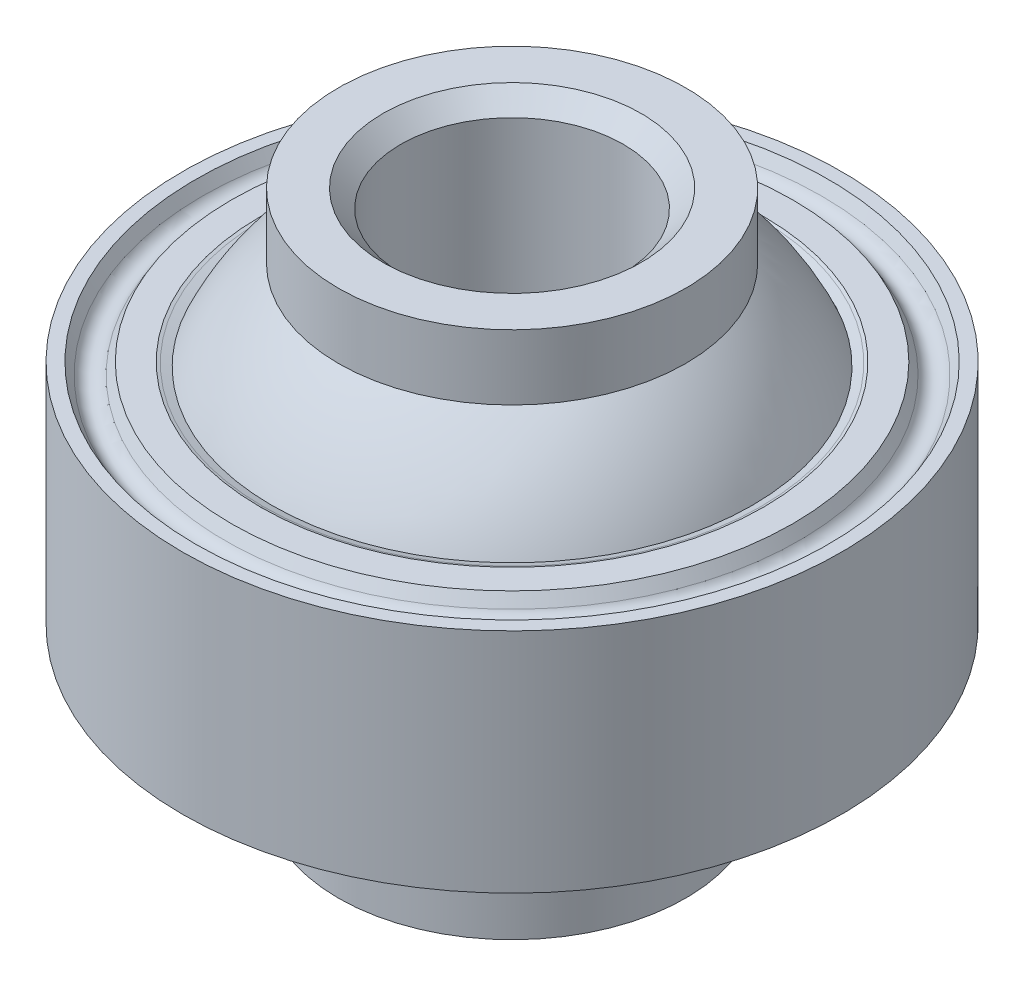
ISO-10303-21;
HEADER;
FILE_DESCRIPTION(('STEP AP214'),'2;1');
FILE_NAME('part.step','',(''),(''),'','','');
FILE_SCHEMA(('AUTOMOTIVE_DESIGN { 1 0 10303 214 1 1 1 1 }'));
ENDSEC;
DATA;
#1=APPLICATION_CONTEXT('core data for automotive mechanical design processes');
#2=APPLICATION_PROTOCOL_DEFINITION('international standard','automotive_design',2000,#1);
#3=PRODUCT_CONTEXT('',#1,'mechanical');
#4=PRODUCT('Part','Part','',(#3));
#5=PRODUCT_RELATED_PRODUCT_CATEGORY('part','',(#4));
#6=PRODUCT_DEFINITION_FORMATION('','',#4);
#7=PRODUCT_DEFINITION_CONTEXT('part definition',#1,'design');
#8=PRODUCT_DEFINITION('design','',#6,#7);
#9=PRODUCT_DEFINITION_SHAPE('','',#8);
#10=(LENGTH_UNIT() NAMED_UNIT(*) SI_UNIT(.MILLI.,.METRE.));
#11=(NAMED_UNIT(*) PLANE_ANGLE_UNIT() SI_UNIT($,.RADIAN.));
#12=(NAMED_UNIT(*) SI_UNIT($,.STERADIAN.) SOLID_ANGLE_UNIT());
#13=UNCERTAINTY_MEASURE_WITH_UNIT(LENGTH_MEASURE(1.E-05),#10,'distance_accuracy_value','');
#14=(GEOMETRIC_REPRESENTATION_CONTEXT(3) GLOBAL_UNCERTAINTY_ASSIGNED_CONTEXT((#13)) GLOBAL_UNIT_ASSIGNED_CONTEXT((#10,
#11,#12)) REPRESENTATION_CONTEXT('',''));
#15=CARTESIAN_POINT('',(0.,0.,0.));
#16=DIRECTION('',(0.,0.,1.));
#17=DIRECTION('',(1.,0.,0.));
#18=AXIS2_PLACEMENT_3D('',#15,#16,#17);
#19=CARTESIAN_POINT('',(0.,0.,0.));
#20=DIRECTION('',(0.,1.,0.));
#21=DIRECTION('',(0.,0.,1.));
#22=AXIS2_PLACEMENT_3D('',#19,#20,#21);
#23=CYLINDRICAL_SURFACE('',#22,3.175);
#24=CARTESIAN_POINT('',(0.,7.02310000002626,0.));
#25=DIRECTION('',(0.,1.,0.));
#26=DIRECTION('',(0.,0.,-1.));
#27=AXIS2_PLACEMENT_3D('',#24,#25,#26);
#28=CIRCLE('',#27,3.17499999999882);
#29=CARTESIAN_POINT('',(0.,7.02310000002626,-3.17499999999882));
#30=VERTEX_POINT('',#29);
#31=EDGE_CURVE('P0_E57',#30,#30,#28,.T.);
#32=ORIENTED_EDGE('',*,*,#31,.T.);
#33=EDGE_LOOP('',(#32));
#34=FACE_BOUND('',#33,.T.);
#35=CARTESIAN_POINT('',(0.,-7.02310000002626,0.));
#36=DIRECTION('',(0.,-1.,0.));
#37=DIRECTION('',(0.,0.,-1.));
#38=AXIS2_PLACEMENT_3D('',#35,#36,#37);
#39=CIRCLE('',#38,3.17499999999882);
#40=CARTESIAN_POINT('',(0.,-7.02310000002626,-3.17499999999882));
#41=VERTEX_POINT('',#40);
#42=EDGE_CURVE('P0_E60',#41,#41,#39,.T.);
#43=ORIENTED_EDGE('',*,*,#42,.T.);
#44=EDGE_LOOP('',(#43));
#45=FACE_BOUND('',#44,.T.);
#46=ADVANCED_FACE('P0_F24',(#34,#45),#23,.F.);
#47=CARTESIAN_POINT('',(0.,-7.53110000010793,0.));
#48=DIRECTION('',(0.,-1.,0.));
#49=DIRECTION('',(0.,0.,-1.));
#50=AXIS2_PLACEMENT_3D('',#47,#48,#49);
#51=CONICAL_SURFACE('',#50,3.68300000008048,0.785398163397448);
#52=CARTESIAN_POINT('',(0.,-7.53110000005108,0.));
#53=DIRECTION('',(0.,-1.,0.));
#54=DIRECTION('',(0.,0.,-1.));
#55=AXIS2_PLACEMENT_3D('',#52,#53,#54);
#56=CIRCLE('',#55,3.68300000002364);
#57=CARTESIAN_POINT('',(0.,-7.53110000005108,-3.68300000002364));
#58=VERTEX_POINT('',#57);
#59=EDGE_CURVE('P0_E27',#58,#58,#56,.F.);
#60=ORIENTED_EDGE('',*,*,#59,.F.);
#61=EDGE_LOOP('',(#60));
#62=FACE_BOUND('',#61,.T.);
#63=ORIENTED_EDGE('',*,*,#42,.F.);
#64=EDGE_LOOP('',(#63));
#65=FACE_BOUND('',#64,.T.);
#66=ADVANCED_FACE('P0_F78',(#62,#65),#51,.F.);
#67=CARTESIAN_POINT('',(0.,7.53110000010793,0.));
#68=DIRECTION('',(0.,1.,0.));
#69=DIRECTION('',(-1.,0.,0.));
#70=AXIS2_PLACEMENT_3D('',#67,#68,#69);
#71=CONICAL_SURFACE('',#70,3.68300000008048,0.785398163397448);
#72=CARTESIAN_POINT('',(0.,7.53110000005108,0.));
#73=DIRECTION('',(0.,1.,0.));
#74=DIRECTION('',(-1.,0.,0.));
#75=AXIS2_PLACEMENT_3D('',#72,#73,#74);
#76=CIRCLE('',#75,3.68300000002364);
#77=CARTESIAN_POINT('',(-3.68300000002364,7.53110000005108,0.));
#78=VERTEX_POINT('',#77);
#79=EDGE_CURVE('P0_E69',#78,#78,#76,.F.);
#80=ORIENTED_EDGE('',*,*,#79,.F.);
#81=EDGE_LOOP('',(#80));
#82=FACE_BOUND('',#81,.T.);
#83=ORIENTED_EDGE('',*,*,#31,.F.);
#84=EDGE_LOOP('',(#83));
#85=FACE_BOUND('',#84,.T.);
#86=ADVANCED_FACE('P0_F81',(#82,#85),#71,.F.);
#87=CARTESIAN_POINT('',(0.,-7.5311,0.));
#88=DIRECTION('',(0.,-1.,0.));
#89=DIRECTION('',(0.,0.,-1.));
#90=AXIS2_PLACEMENT_3D('',#87,#88,#89);
#91=PLANE('',#90);
#92=CARTESIAN_POINT('',(0.,-7.5311,0.));
#93=DIRECTION('',(0.,1.,0.));
#94=DIRECTION('',(0.,0.,1.));
#95=AXIS2_PLACEMENT_3D('',#92,#93,#94);
#96=CIRCLE('',#95,4.953);
#97=CARTESIAN_POINT('',(0.,-7.5311,4.953));
#98=VERTEX_POINT('',#97);
#99=EDGE_CURVE('P0_E67',#98,#98,#96,.T.);
#100=ORIENTED_EDGE('',*,*,#99,.F.);
#101=EDGE_LOOP('',(#100));
#102=FACE_BOUND('',#101,.T.);
#103=ORIENTED_EDGE('',*,*,#59,.T.);
#104=EDGE_LOOP('',(#103));
#105=FACE_BOUND('',#104,.T.);
#106=ADVANCED_FACE('P0_F76',(#102,#105),#91,.T.);
#107=CARTESIAN_POINT('',(0.,7.5311,0.));
#108=DIRECTION('',(0.,1.,0.));
#109=DIRECTION('',(0.,0.,1.));
#110=AXIS2_PLACEMENT_3D('',#107,#108,#109);
#111=PLANE('',#110);
#112=CARTESIAN_POINT('',(0.,7.5311,0.));
#113=DIRECTION('',(0.,1.,0.));
#114=DIRECTION('',(0.,0.,1.));
#115=AXIS2_PLACEMENT_3D('',#112,#113,#114);
#116=CIRCLE('',#115,4.953);
#117=CARTESIAN_POINT('',(0.,7.5311,4.953));
#118=VERTEX_POINT('',#117);
#119=EDGE_CURVE('P0_E64',#118,#118,#116,.F.);
#120=ORIENTED_EDGE('',*,*,#119,.F.);
#121=EDGE_LOOP('',(#120));
#122=FACE_BOUND('',#121,.T.);
#123=ORIENTED_EDGE('',*,*,#79,.T.);
#124=EDGE_LOOP('',(#123));
#125=FACE_BOUND('',#124,.T.);
#126=ADVANCED_FACE('P0_F96',(#122,#125),#111,.T.);
#127=CARTESIAN_POINT('',(0.,0.,0.));
#128=DIRECTION('',(0.,1.,0.));
#129=DIRECTION('',(0.,0.,1.));
#130=AXIS2_PLACEMENT_3D('',#127,#128,#129);
#131=CYLINDRICAL_SURFACE('',#130,4.953);
#132=ORIENTED_EDGE('',*,*,#99,.T.);
#133=EDGE_LOOP('',(#132));
#134=FACE_BOUND('',#133,.T.);
#135=CARTESIAN_POINT('',(0.,-5.6732052853744,0.));
#136=DIRECTION('',(0.,1.,0.));
#137=DIRECTION('',(0.,0.,1.));
#138=AXIS2_PLACEMENT_3D('',#135,#136,#137);
#139=CIRCLE('',#138,4.953);
#140=CARTESIAN_POINT('',(0.,-5.6732052853744,4.953));
#141=VERTEX_POINT('',#140);
#142=EDGE_CURVE('P0_E33',#141,#141,#139,.T.);
#143=ORIENTED_EDGE('',*,*,#142,.F.);
#144=EDGE_LOOP('',(#143));
#145=FACE_BOUND('',#144,.T.);
#146=ADVANCED_FACE('P0_F48',(#134,#145),#131,.T.);
#147=CARTESIAN_POINT('',(0.,0.,0.));
#148=DIRECTION('',(0.,1.,0.));
#149=DIRECTION('',(0.,0.,1.));
#150=AXIS2_PLACEMENT_3D('',#147,#148,#149);
#151=CYLINDRICAL_SURFACE('',#150,4.953);
#152=CARTESIAN_POINT('',(0.,5.6732052853744,0.));
#153=DIRECTION('',(0.,1.,0.));
#154=DIRECTION('',(0.,0.,1.));
#155=AXIS2_PLACEMENT_3D('',#152,#153,#154);
#156=CIRCLE('',#155,4.953);
#157=CARTESIAN_POINT('',(0.,5.6732052853744,4.953));
#158=VERTEX_POINT('',#157);
#159=EDGE_CURVE('P0_E13',#158,#158,#156,.F.);
#160=ORIENTED_EDGE('',*,*,#159,.F.);
#161=EDGE_LOOP('',(#160));
#162=FACE_BOUND('',#161,.T.);
#163=ORIENTED_EDGE('',*,*,#119,.T.);
#164=EDGE_LOOP('',(#163));
#165=FACE_BOUND('',#164,.T.);
#166=ADVANCED_FACE('P0_F41',(#162,#165),#151,.T.);
#167=CARTESIAN_POINT('',(0.,0.,0.));
#168=DIRECTION('',(1.,0.,0.));
#169=DIRECTION('',(0.,1.,0.));
#170=AXIS2_PLACEMENT_3D('',#167,#168,#169);
#171=SPHERICAL_SURFACE('',#170,7.5311);
#172=ORIENTED_EDGE('',*,*,#142,.T.);
#173=EDGE_LOOP('',(#172));
#174=FACE_BOUND('',#173,.T.);
#175=ORIENTED_EDGE('',*,*,#159,.T.);
#176=EDGE_LOOP('',(#175));
#177=FACE_BOUND('',#176,.T.);
#178=CARTESIAN_POINT('',(-7.5311,0.,0.));
#179=VERTEX_POINT('',#178);
#180=VERTEX_LOOP('',#179);
#181=FACE_BOUND('',#180,.T.);
#182=CARTESIAN_POINT('',(7.5311,0.,0.));
#183=VERTEX_POINT('',#182);
#184=VERTEX_LOOP('',#183);
#185=FACE_BOUND('',#184,.T.);
#186=ADVANCED_FACE('P0_F39',(#174,#177,#181,#185),#171,.T.);
#187=CLOSED_SHELL('',(#46,#66,#86,#106,#126,#146,#166,#186));
#188=MANIFOLD_SOLID_BREP('P0_B1',#187);
#189=CARTESIAN_POINT('',(0.,0.,0.));
#190=DIRECTION('',(0.,-1.,0.));
#191=DIRECTION('',(0.,0.,-1.));
#192=AXIS2_PLACEMENT_3D('',#189,#190,#191);
#193=DEGENERATE_TOROIDAL_SURFACE('',#192,0.00762000000000092,7.52422121857329,.T.);
#194=CARTESIAN_POINT('',(0.,3.12138692186181,0.));
#195=DIRECTION('',(0.,1.,0.));
#196=DIRECTION('',(1.,0.,0.));
#197=AXIS2_PLACEMENT_3D('',#194,#195,#196);
#198=CIRCLE('',#197,6.85384878886452);
#199=CARTESIAN_POINT('',(6.85384878886452,3.12138692186181,0.));
#200=VERTEX_POINT('',#199);
#201=EDGE_CURVE('P1_E133',#200,#200,#198,.T.);
#202=ORIENTED_EDGE('',*,*,#201,.T.);
#203=EDGE_LOOP('',(#202));
#204=FACE_BOUND('',#203,.T.);
#205=CARTESIAN_POINT('',(0.,-3.12138692189023,0.));
#206=DIRECTION('',(0.,-1.,0.));
#207=DIRECTION('',(1.,0.,0.));
#208=AXIS2_PLACEMENT_3D('',#205,#206,#207);
#209=CIRCLE('',#208,6.85384878880768);
#210=CARTESIAN_POINT('',(6.85384878880768,-3.12138692189023,0.));
#211=VERTEX_POINT('',#210);
#212=EDGE_CURVE('P1_E137',#211,#211,#209,.T.);
#213=ORIENTED_EDGE('',*,*,#212,.T.);
#214=EDGE_LOOP('',(#213));
#215=FACE_BOUND('',#214,.T.);
#216=ADVANCED_FACE('P1_F24',(#204,#215),#193,.F.);
#217=CARTESIAN_POINT('',(0.,-3.20848073371849,0.));
#218=DIRECTION('',(0.,-1.,0.));
#219=DIRECTION('',(1.,0.,0.));
#220=AXIS2_PLACEMENT_3D('',#217,#218,#219);
#221=CONICAL_SURFACE('',#220,7.09326707806213,1.22190500926642);
#222=ORIENTED_EDGE('',*,*,#212,.F.);
#223=EDGE_LOOP('',(#222));
#224=FACE_BOUND('',#223,.T.);
#225=CARTESIAN_POINT('',(0.,-3.2084807338012,0.));
#226=DIRECTION('',(0.,-1.,0.));
#227=DIRECTION('',(-1.,0.,0.));
#228=AXIS2_PLACEMENT_3D('',#225,#226,#227);
#229=CIRCLE('',#228,7.0932670782895);
#230=CARTESIAN_POINT('',(-7.09326914803703,-3.20847333234299,0.));
#231=VERTEX_POINT('',#230);
#232=CARTESIAN_POINT('',(0.,-3.20847345069136,-7.09326951839364));
#233=VERTEX_POINT('',#232);
#234=EDGE_CURVE('P1_E250',#231,#233,#229,.T.);
#235=ORIENTED_EDGE('',*,*,#234,.T.);
#236=CARTESIAN_POINT('',(0.,-3.2084807338012,0.));
#237=DIRECTION('',(0.,-1.,0.));
#238=DIRECTION('',(0.,0.,-1.));
#239=AXIS2_PLACEMENT_3D('',#236,#237,#238);
#240=CIRCLE('',#239,7.0932670782895);
#241=CARTESIAN_POINT('',(0.,-3.20847343916724,7.09326941906428));
#242=VERTEX_POINT('',#241);
#243=EDGE_CURVE('P1_E76',#233,#242,#240,.T.);
#244=ORIENTED_EDGE('',*,*,#243,.T.);
#245=CARTESIAN_POINT('',(0.,-3.20848033326683,0.));
#246=DIRECTION('',(0.,-1.,0.));
#247=DIRECTION('',(0.,0.,1.));
#248=AXIS2_PLACEMENT_3D('',#245,#246,#247);
#249=CIRCLE('',#248,7.09326597723248);
#250=EDGE_CURVE('P1_E136',#242,#231,#249,.T.);
#251=ORIENTED_EDGE('',*,*,#250,.T.);
#252=EDGE_LOOP('',(#235,#244,#251));
#253=FACE_BOUND('',#252,.T.);
#254=ADVANCED_FACE('P1_F284',(#224,#253),#221,.F.);
#255=CARTESIAN_POINT('',(0.,3.20848073371849,0.));
#256=DIRECTION('',(0.,1.,0.));
#257=DIRECTION('',(0.,0.,1.));
#258=AXIS2_PLACEMENT_3D('',#255,#256,#257);
#259=CONICAL_SURFACE('',#258,7.09326707823266,1.22190500937126);
#260=ORIENTED_EDGE('',*,*,#201,.F.);
#261=EDGE_LOOP('',(#260));
#262=FACE_BOUND('',#261,.T.);
#263=CARTESIAN_POINT('',(0.,3.20848073371849,0.));
#264=DIRECTION('',(0.,1.,0.));
#265=DIRECTION('',(-1.,0.,0.));
#266=AXIS2_PLACEMENT_3D('',#263,#264,#265);
#267=CIRCLE('',#266,7.09326707823266);
#268=CARTESIAN_POINT('',(-7.09326914800861,3.20847333230164,0.));
#269=VERTEX_POINT('',#268);
#270=CARTESIAN_POINT('',(0.,3.20847338417803,7.0932693357914));
#271=VERTEX_POINT('',#270);
#272=EDGE_CURVE('P1_E61',#269,#271,#267,.T.);
#273=ORIENTED_EDGE('',*,*,#272,.T.);
#274=CARTESIAN_POINT('',(0.,3.20848073371849,0.));
#275=DIRECTION('',(0.,1.,0.));
#276=DIRECTION('',(0.,0.,1.));
#277=AXIS2_PLACEMENT_3D('',#274,#275,#276);
#278=CIRCLE('',#277,7.09326707823266);
#279=CARTESIAN_POINT('',(0.,3.20847343912586,-7.09326941903571));
#280=VERTEX_POINT('',#279);
#281=EDGE_CURVE('P1_E79',#271,#280,#278,.T.);
#282=ORIENTED_EDGE('',*,*,#281,.T.);
#283=CARTESIAN_POINT('',(0.,3.20848033318412,0.));
#284=DIRECTION('',(0.,1.,0.));
#285=DIRECTION('',(0.,0.,-1.));
#286=AXIS2_PLACEMENT_3D('',#283,#284,#285);
#287=CIRCLE('',#286,7.09326597717563);
#288=EDGE_CURVE('P1_E84',#280,#269,#287,.T.);
#289=ORIENTED_EDGE('',*,*,#288,.T.);
#290=EDGE_LOOP('',(#273,#282,#289));
#291=FACE_BOUND('',#290,.T.);
#292=ADVANCED_FACE('P1_F82',(#262,#291),#259,.F.);
#293=CARTESIAN_POINT('',(0.,-3.23849999992376,0.));
#294=DIRECTION('',(0.,-1.,0.));
#295=DIRECTION('',(1.,0.,0.));
#296=AXIS2_PLACEMENT_3D('',#293,#294,#295);
#297=CONICAL_SURFACE('',#296,7.17578914486694,1.22173047635966);
#298=ORIENTED_EDGE('',*,*,#234,.F.);
#299=ORIENTED_EDGE('',*,*,#250,.F.);
#300=DIRECTION('',(0.,0.34202014332567,-0.939692620785908));
#301=VECTOR('',#300,1.);
#302=CARTESIAN_POINT('',(5.10278230133358E-11,-181621.773625179,499000.));
#303=LINE('',#302,#301);
#304=CARTESIAN_POINT('',(0.,-3.23849999998583,7.17578914503747));
#305=VERTEX_POINT('',#304);
#306=EDGE_CURVE('P1_E141',#242,#305,#303,.F.);
#307=ORIENTED_EDGE('',*,*,#306,.T.);
#308=CARTESIAN_POINT('',(0.,-3.23849999998583,0.));
#309=DIRECTION('',(0.,-1.,0.));
#310=DIRECTION('',(1.,0.,0.));
#311=AXIS2_PLACEMENT_3D('',#308,#309,#310);
#312=CIRCLE('',#311,7.17578914503747);
#313=CARTESIAN_POINT('',(0.,-3.23849999998583,-7.17578914503747));
#314=VERTEX_POINT('',#313);
#315=EDGE_CURVE('P1_E27',#314,#305,#312,.F.);
#316=ORIENTED_EDGE('',*,*,#315,.F.);
#317=DIRECTION('',(0.,0.342020143325669,0.939692620785908));
#318=VECTOR('',#317,1.);
#319=CARTESIAN_POINT('',(-1.00820522641172E-11,-181621.773625179,-499000.));
#320=LINE('',#319,#318);
#321=EDGE_CURVE('P1_E87',#314,#233,#320,.T.);
#322=ORIENTED_EDGE('',*,*,#321,.T.);
#323=EDGE_LOOP('',(#298,#299,#307,#316,#322));
#324=FACE_BOUND('',#323,.T.);
#325=ADVANCED_FACE('P1_F249',(#324),#297,.F.);
#326=CARTESIAN_POINT('',(0.,-3.23849999992376,0.));
#327=DIRECTION('',(0.,-1.,0.));
#328=DIRECTION('',(1.,0.,0.));
#329=AXIS2_PLACEMENT_3D('',#326,#327,#328);
#330=CONICAL_SURFACE('',#329,7.17578914486694,1.22173047630567);
#331=CARTESIAN_POINT('',(0.,-3.23849999998583,0.));
#332=DIRECTION('',(0.,-1.,0.));
#333=DIRECTION('',(1.,0.,0.));
#334=AXIS2_PLACEMENT_3D('',#331,#332,#333);
#335=CIRCLE('',#334,7.17578914503747);
#336=EDGE_CURVE('P1_E238',#305,#314,#335,.F.);
#337=ORIENTED_EDGE('',*,*,#336,.F.);
#338=ORIENTED_EDGE('',*,*,#306,.F.);
#339=ORIENTED_EDGE('',*,*,#243,.F.);
#340=ORIENTED_EDGE('',*,*,#321,.F.);
#341=EDGE_LOOP('',(#337,#338,#339,#340));
#342=FACE_BOUND('',#341,.T.);
#343=ADVANCED_FACE('P1_F246',(#342),#330,.F.);
#344=CARTESIAN_POINT('',(0.,3.23849999992376,0.));
#345=DIRECTION('',(0.,1.,0.));
#346=DIRECTION('',(-1.,0.,0.));
#347=AXIS2_PLACEMENT_3D('',#344,#345,#346);
#348=CONICAL_SURFACE('',#347,7.17578914486694,1.22173047630567);
#349=ORIENTED_EDGE('',*,*,#281,.F.);
#350=DIRECTION('',(0.,-0.34202014332567,-0.939692620785908));
#351=VECTOR('',#350,1.);
#352=CARTESIAN_POINT('',(-2.58227915002348E-11,181621.773625179,499000.));
#353=LINE('',#352,#351);
#354=CARTESIAN_POINT('',(0.,3.23849999998583,7.17578914503747));
#355=VERTEX_POINT('',#354);
#356=EDGE_CURVE('P1_E42',#271,#355,#353,.F.);
#357=ORIENTED_EDGE('',*,*,#356,.T.);
#358=CARTESIAN_POINT('',(0.,3.23849999998583,0.));
#359=DIRECTION('',(0.,1.,0.));
#360=DIRECTION('',(-1.,0.,0.));
#361=AXIS2_PLACEMENT_3D('',#358,#359,#360);
#362=CIRCLE('',#361,7.17578914503747);
#363=CARTESIAN_POINT('',(0.,3.23849999998583,-7.17578914503747));
#364=VERTEX_POINT('',#363);
#365=EDGE_CURVE('P1_E94',#364,#355,#362,.F.);
#366=ORIENTED_EDGE('',*,*,#365,.F.);
#367=DIRECTION('',(0.,-0.342020143325669,0.939692620785908));
#368=VECTOR('',#367,1.);
#369=CARTESIAN_POINT('',(3.52870837772181E-11,181621.773625179,-499000.));
#370=LINE('',#369,#368);
#371=EDGE_CURVE('P1_E91',#364,#280,#370,.T.);
#372=ORIENTED_EDGE('',*,*,#371,.T.);
#373=EDGE_LOOP('',(#349,#357,#366,#372));
#374=FACE_BOUND('',#373,.T.);
#375=ADVANCED_FACE('P1_F92',(#374),#348,.F.);
#376=CARTESIAN_POINT('',(0.,3.23849999992376,0.));
#377=DIRECTION('',(0.,1.,0.));
#378=DIRECTION('',(-1.,0.,0.));
#379=AXIS2_PLACEMENT_3D('',#376,#377,#378);
#380=CONICAL_SURFACE('',#379,7.17578914486694,1.22173047635966);
#381=CARTESIAN_POINT('',(0.,3.23849999998583,0.));
#382=DIRECTION('',(0.,1.,0.));
#383=DIRECTION('',(-1.,0.,0.));
#384=AXIS2_PLACEMENT_3D('',#381,#382,#383);
#385=CIRCLE('',#384,7.17578914503747);
#386=EDGE_CURVE('P1_E236',#355,#364,#385,.F.);
#387=ORIENTED_EDGE('',*,*,#386,.F.);
#388=ORIENTED_EDGE('',*,*,#356,.F.);
#389=ORIENTED_EDGE('',*,*,#272,.F.);
#390=ORIENTED_EDGE('',*,*,#288,.F.);
#391=ORIENTED_EDGE('',*,*,#371,.F.);
#392=EDGE_LOOP('',(#387,#388,#389,#390,#391));
#393=FACE_BOUND('',#392,.T.);
#394=ADVANCED_FACE('P1_F99',(#393),#380,.F.);
#395=CARTESIAN_POINT('',(0.,-3.2385,0.));
#396=DIRECTION('',(0.,-1.,0.));
#397=DIRECTION('',(0.,0.,-1.));
#398=AXIS2_PLACEMENT_3D('',#395,#396,#397);
#399=PLANE('',#398);
#400=ORIENTED_EDGE('',*,*,#315,.T.);
#401=ORIENTED_EDGE('',*,*,#336,.T.);
#402=EDGE_LOOP('',(#400,#401));
#403=FACE_BOUND('',#402,.T.);
#404=CARTESIAN_POINT('',(0.,-3.2385,0.));
#405=DIRECTION('',(0.,1.,0.));
#406=DIRECTION('',(0.,0.,1.));
#407=AXIS2_PLACEMENT_3D('',#404,#405,#406);
#408=CIRCLE('',#407,8.001);
#409=CARTESIAN_POINT('',(0.,-3.2385,8.001));
#410=VERTEX_POINT('',#409);
#411=EDGE_CURVE('P1_E233',#410,#410,#408,.T.);
#412=ORIENTED_EDGE('',*,*,#411,.F.);
#413=EDGE_LOOP('',(#412));
#414=FACE_BOUND('',#413,.T.);
#415=ADVANCED_FACE('P1_F119',(#403,#414),#399,.T.);
#416=CARTESIAN_POINT('',(0.,3.2385,0.));
#417=DIRECTION('',(0.,1.,0.));
#418=DIRECTION('',(0.,0.,1.));
#419=AXIS2_PLACEMENT_3D('',#416,#417,#418);
#420=PLANE('',#419);
#421=ORIENTED_EDGE('',*,*,#365,.T.);
#422=ORIENTED_EDGE('',*,*,#386,.T.);
#423=EDGE_LOOP('',(#421,#422));
#424=FACE_BOUND('',#423,.T.);
#425=CARTESIAN_POINT('',(0.,3.2385,0.));
#426=DIRECTION('',(0.,-1.,0.));
#427=DIRECTION('',(0.,0.,-1.));
#428=AXIS2_PLACEMENT_3D('',#425,#426,#427);
#429=CIRCLE('',#428,8.001);
#430=CARTESIAN_POINT('',(0.,3.2385,-8.001));
#431=VERTEX_POINT('',#430);
#432=EDGE_CURVE('P1_E154',#431,#431,#429,.T.);
#433=ORIENTED_EDGE('',*,*,#432,.F.);
#434=EDGE_LOOP('',(#433));
#435=FACE_BOUND('',#434,.T.);
#436=ADVANCED_FACE('P1_F175',(#424,#435),#420,.T.);
#437=CARTESIAN_POINT('',(0.,-2.9164409051225,0.));
#438=DIRECTION('',(0.,1.,0.));
#439=DIRECTION('',(0.,0.,1.));
#440=AXIS2_PLACEMENT_3D('',#437,#438,#439);
#441=CONICAL_SURFACE('',#440,8.1869409051225,0.523598775598297);
#442=CARTESIAN_POINT('',(0.,-2.91644090512249,0.));
#443=DIRECTION('',(0.,-1.,0.));
#444=DIRECTION('',(0.,0.,-1.));
#445=AXIS2_PLACEMENT_3D('',#442,#443,#444);
#446=CIRCLE('',#445,8.18694090512249);
#447=CARTESIAN_POINT('',(0.,-2.9164409051225,-8.18694090512249));
#448=VERTEX_POINT('',#447);
#449=EDGE_CURVE('P1_E150',#448,#448,#446,.T.);
#450=ORIENTED_EDGE('',*,*,#449,.T.);
#451=EDGE_LOOP('',(#450));
#452=FACE_BOUND('',#451,.T.);
#453=ORIENTED_EDGE('',*,*,#411,.T.);
#454=EDGE_LOOP('',(#453));
#455=FACE_BOUND('',#454,.T.);
#456=ADVANCED_FACE('P1_F172',(#452,#455),#441,.T.);
#457=CARTESIAN_POINT('',(0.,2.9164409051225,0.));
#458=DIRECTION('',(0.,-1.,0.));
#459=DIRECTION('',(0.,0.,-1.));
#460=AXIS2_PLACEMENT_3D('',#457,#458,#459);
#461=CONICAL_SURFACE('',#460,8.1869409051225,0.523598775598298);
#462=CARTESIAN_POINT('',(0.,2.91644090512249,0.));
#463=DIRECTION('',(0.,1.,0.));
#464=DIRECTION('',(0.,0.,-1.));
#465=AXIS2_PLACEMENT_3D('',#462,#463,#464);
#466=CIRCLE('',#465,8.18694090512249);
#467=CARTESIAN_POINT('',(0.,2.9164409051225,-8.18694090512249));
#468=VERTEX_POINT('',#467);
#469=EDGE_CURVE('P1_E153',#468,#468,#466,.T.);
#470=ORIENTED_EDGE('',*,*,#469,.T.);
#471=EDGE_LOOP('',(#470));
#472=FACE_BOUND('',#471,.T.);
#473=ORIENTED_EDGE('',*,*,#432,.T.);
#474=EDGE_LOOP('',(#473));
#475=FACE_BOUND('',#474,.T.);
#476=ADVANCED_FACE('P1_F167',(#472,#475),#461,.T.);
#477=CARTESIAN_POINT('',(0.,-3.10238181024499,0.));
#478=DIRECTION('',(0.,-1.,0.));
#479=DIRECTION('',(0.,0.,-1.));
#480=AXIS2_PLACEMENT_3D('',#477,#478,#479);
#481=TOROIDAL_SURFACE('',#480,8.509,0.371881810244991);
#482=ORIENTED_EDGE('',*,*,#449,.F.);
#483=EDGE_LOOP('',(#482));
#484=FACE_BOUND('',#483,.T.);
#485=CARTESIAN_POINT('',(0.,-2.91644090512249,0.));
#486=DIRECTION('',(0.,-1.,0.));
#487=DIRECTION('',(0.,0.,1.));
#488=AXIS2_PLACEMENT_3D('',#485,#486,#487);
#489=CIRCLE('',#488,8.8310590948775);
#490=CARTESIAN_POINT('',(0.,-2.91644090512249,8.8310590948775));
#491=VERTEX_POINT('',#490);
#492=EDGE_CURVE('P1_E157',#491,#491,#489,.T.);
#493=ORIENTED_EDGE('',*,*,#492,.T.);
#494=EDGE_LOOP('',(#493));
#495=FACE_BOUND('',#494,.T.);
#496=ADVANCED_FACE('P1_F162',(#484,#495),#481,.F.);
#497=CARTESIAN_POINT('',(0.,3.10238181024499,0.));
#498=DIRECTION('',(0.,1.,0.));
#499=DIRECTION('',(0.,0.,-1.));
#500=AXIS2_PLACEMENT_3D('',#497,#498,#499);
#501=TOROIDAL_SURFACE('',#500,8.509,0.371881810244991);
#502=ORIENTED_EDGE('',*,*,#469,.F.);
#503=EDGE_LOOP('',(#502));
#504=FACE_BOUND('',#503,.T.);
#505=CARTESIAN_POINT('',(0.,2.91644090512249,0.));
#506=DIRECTION('',(0.,1.,0.));
#507=DIRECTION('',(0.,0.,1.));
#508=AXIS2_PLACEMENT_3D('',#505,#506,#507);
#509=CIRCLE('',#508,8.8310590948775);
#510=CARTESIAN_POINT('',(0.,2.91644090512249,8.8310590948775));
#511=VERTEX_POINT('',#510);
#512=EDGE_CURVE('P1_E219',#511,#511,#509,.T.);
#513=ORIENTED_EDGE('',*,*,#512,.T.);
#514=EDGE_LOOP('',(#513));
#515=FACE_BOUND('',#514,.T.);
#516=ADVANCED_FACE('P1_F166',(#504,#515),#501,.F.);
#517=CARTESIAN_POINT('',(0.,-3.2385,0.));
#518=DIRECTION('',(0.,-1.,0.));
#519=DIRECTION('',(0.,0.,-1.));
#520=AXIS2_PLACEMENT_3D('',#517,#518,#519);
#521=CONICAL_SURFACE('',#520,9.01699999999999,0.523598775598297);
#522=CARTESIAN_POINT('',(0.,-3.2385,0.));
#523=DIRECTION('',(0.,-1.,0.));
#524=DIRECTION('',(0.,0.,-1.));
#525=AXIS2_PLACEMENT_3D('',#522,#523,#524);
#526=CIRCLE('',#525,9.01699999999999);
#527=CARTESIAN_POINT('',(0.,-3.2385,-9.01699999999999));
#528=VERTEX_POINT('',#527);
#529=EDGE_CURVE('P1_E215',#528,#528,#526,.F.);
#530=ORIENTED_EDGE('',*,*,#529,.F.);
#531=EDGE_LOOP('',(#530));
#532=FACE_BOUND('',#531,.T.);
#533=ORIENTED_EDGE('',*,*,#492,.F.);
#534=EDGE_LOOP('',(#533));
#535=FACE_BOUND('',#534,.T.);
#536=ADVANCED_FACE('P1_F204',(#532,#535),#521,.F.);
#537=CARTESIAN_POINT('',(0.,3.2385,0.));
#538=DIRECTION('',(0.,1.,0.));
#539=DIRECTION('',(0.,0.,1.));
#540=AXIS2_PLACEMENT_3D('',#537,#538,#539);
#541=CONICAL_SURFACE('',#540,9.01699999999999,0.523598775598297);
#542=CARTESIAN_POINT('',(0.,3.2385,0.));
#543=DIRECTION('',(0.,1.,0.));
#544=DIRECTION('',(0.,0.,1.));
#545=AXIS2_PLACEMENT_3D('',#542,#543,#544);
#546=CIRCLE('',#545,9.01699999999999);
#547=CARTESIAN_POINT('',(0.,3.2385,9.01699999999999));
#548=VERTEX_POINT('',#547);
#549=EDGE_CURVE('P1_E224',#548,#548,#546,.F.);
#550=ORIENTED_EDGE('',*,*,#549,.F.);
#551=EDGE_LOOP('',(#550));
#552=FACE_BOUND('',#551,.T.);
#553=ORIENTED_EDGE('',*,*,#512,.F.);
#554=EDGE_LOOP('',(#553));
#555=FACE_BOUND('',#554,.T.);
#556=ADVANCED_FACE('P1_F201',(#552,#555),#541,.F.);
#557=CARTESIAN_POINT('',(0.,-3.2385,0.));
#558=DIRECTION('',(0.,-1.,0.));
#559=DIRECTION('',(0.,0.,-1.));
#560=AXIS2_PLACEMENT_3D('',#557,#558,#559);
#561=PLANE('',#560);
#562=ORIENTED_EDGE('',*,*,#529,.T.);
#563=EDGE_LOOP('',(#562));
#564=FACE_BOUND('',#563,.T.);
#565=CARTESIAN_POINT('',(0.,-3.2385,0.));
#566=DIRECTION('',(0.,1.,0.));
#567=DIRECTION('',(0.,0.,1.));
#568=AXIS2_PLACEMENT_3D('',#565,#566,#567);
#569=CIRCLE('',#568,9.398);
#570=CARTESIAN_POINT('',(0.,-3.2385,9.398));
#571=VERTEX_POINT('',#570);
#572=EDGE_CURVE('P1_E33',#571,#571,#569,.T.);
#573=ORIENTED_EDGE('',*,*,#572,.F.);
#574=EDGE_LOOP('',(#573));
#575=FACE_BOUND('',#574,.T.);
#576=ADVANCED_FACE('P1_F193',(#564,#575),#561,.T.);
#577=CARTESIAN_POINT('',(0.,3.2385,0.));
#578=DIRECTION('',(0.,1.,0.));
#579=DIRECTION('',(0.,0.,1.));
#580=AXIS2_PLACEMENT_3D('',#577,#578,#579);
#581=PLANE('',#580);
#582=ORIENTED_EDGE('',*,*,#549,.T.);
#583=EDGE_LOOP('',(#582));
#584=FACE_BOUND('',#583,.T.);
#585=CARTESIAN_POINT('',(0.,3.2385,0.));
#586=DIRECTION('',(0.,1.,0.));
#587=DIRECTION('',(0.,0.,1.));
#588=AXIS2_PLACEMENT_3D('',#585,#586,#587);
#589=CIRCLE('',#588,9.398);
#590=CARTESIAN_POINT('',(0.,3.2385,9.398));
#591=VERTEX_POINT('',#590);
#592=EDGE_CURVE('P1_E13',#591,#591,#589,.F.);
#593=ORIENTED_EDGE('',*,*,#592,.F.);
#594=EDGE_LOOP('',(#593));
#595=FACE_BOUND('',#594,.T.);
#596=ADVANCED_FACE('P1_F187',(#584,#595),#581,.T.);
#597=CARTESIAN_POINT('',(0.,0.,0.));
#598=DIRECTION('',(0.,1.,0.));
#599=DIRECTION('',(0.,0.,1.));
#600=AXIS2_PLACEMENT_3D('',#597,#598,#599);
#601=CYLINDRICAL_SURFACE('',#600,9.398);
#602=ORIENTED_EDGE('',*,*,#572,.T.);
#603=EDGE_LOOP('',(#602));
#604=FACE_BOUND('',#603,.T.);
#605=ORIENTED_EDGE('',*,*,#592,.T.);
#606=EDGE_LOOP('',(#605));
#607=FACE_BOUND('',#606,.T.);
#608=ADVANCED_FACE('P1_F185',(#604,#607),#601,.T.);
#609=CLOSED_SHELL('',(#216,#254,#292,#325,#343,#375,#394,#415,#436,#456,#476,#496,#516,#536,
#556,#576,#596,#608));
#610=MANIFOLD_SOLID_BREP('P1_B1',#609);
#611=ADVANCED_BREP_SHAPE_REPRESENTATION('',(#18,#188,#610),#14);
#612=SHAPE_DEFINITION_REPRESENTATION(#9,#611);
ENDSEC;
END-ISO-10303-21;
